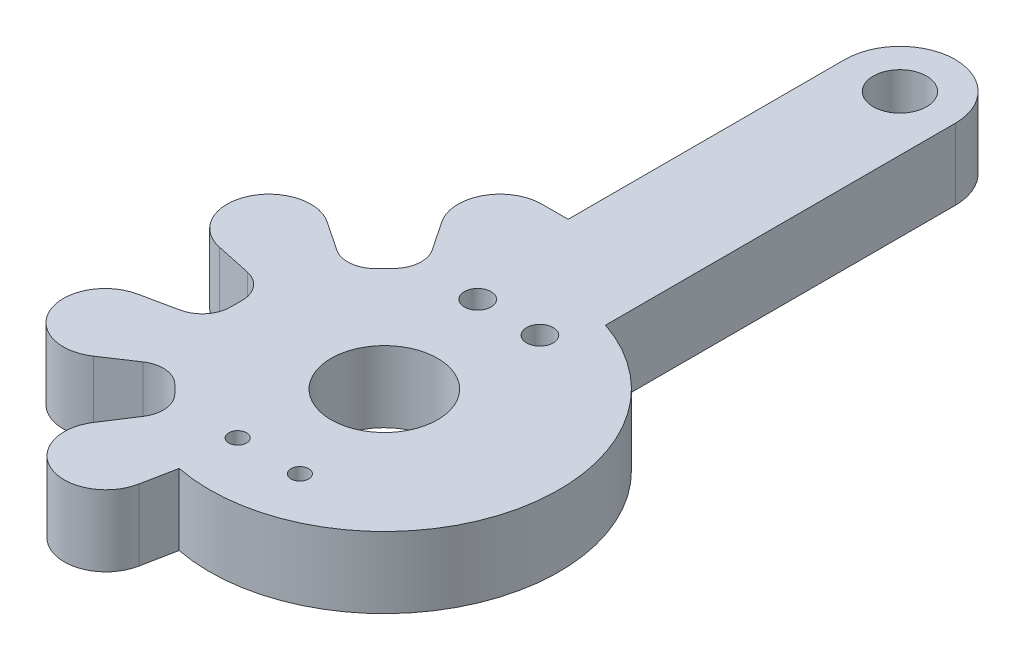
ISO-10303-21;
HEADER;
FILE_DESCRIPTION(('STEP AP214'),'2;1');
FILE_NAME('part.step','',(''),(''),'','','');
FILE_SCHEMA(('AUTOMOTIVE_DESIGN { 1 0 10303 214 1 1 1 1 }'));
ENDSEC;
DATA;
#1=APPLICATION_CONTEXT('core data for automotive mechanical design processes');
#2=APPLICATION_PROTOCOL_DEFINITION('international standard','automotive_design',2000,#1);
#3=PRODUCT_CONTEXT('',#1,'mechanical');
#4=PRODUCT('Part','Part','',(#3));
#5=PRODUCT_RELATED_PRODUCT_CATEGORY('part','',(#4));
#6=PRODUCT_DEFINITION_FORMATION('','',#4);
#7=PRODUCT_DEFINITION_CONTEXT('part definition',#1,'design');
#8=PRODUCT_DEFINITION('design','',#6,#7);
#9=PRODUCT_DEFINITION_SHAPE('','',#8);
#10=(LENGTH_UNIT() NAMED_UNIT(*) SI_UNIT(.MILLI.,.METRE.));
#11=(NAMED_UNIT(*) PLANE_ANGLE_UNIT() SI_UNIT($,.RADIAN.));
#12=(NAMED_UNIT(*) SI_UNIT($,.STERADIAN.) SOLID_ANGLE_UNIT());
#13=UNCERTAINTY_MEASURE_WITH_UNIT(LENGTH_MEASURE(1.E-05),#10,'distance_accuracy_value','');
#14=(GEOMETRIC_REPRESENTATION_CONTEXT(3) GLOBAL_UNCERTAINTY_ASSIGNED_CONTEXT((#13)) GLOBAL_UNIT_ASSIGNED_CONTEXT((#10,
#11,#12)) REPRESENTATION_CONTEXT('',''));
#15=CARTESIAN_POINT('',(0.,0.,0.));
#16=DIRECTION('',(0.,0.,1.));
#17=DIRECTION('',(1.,0.,0.));
#18=AXIS2_PLACEMENT_3D('',#15,#16,#17);
#19=CARTESIAN_POINT('',(-2.77114568886049,4.,-1.37659901968838));
#20=DIRECTION('',(0.,1.,0.));
#21=DIRECTION('',(0.,0.,1.));
#22=AXIS2_PLACEMENT_3D('',#19,#20,#21);
#23=PLANE('',#22);
#24=CARTESIAN_POINT('',(0.0592699758120881,4.,16.2086677180102));
#25=DIRECTION('',(0.,1.,0.));
#26=DIRECTION('',(0.,0.,1.));
#27=AXIS2_PLACEMENT_3D('',#24,#25,#26);
#28=CIRCLE('',#27,0.500000134967007);
#29=CARTESIAN_POINT('',(0.0592699758120881,4.,16.7086678529772));
#30=VERTEX_POINT('',#29);
#31=EDGE_CURVE('E548',#30,#30,#28,.T.);
#32=ORIENTED_EDGE('',*,*,#31,.F.);
#33=EDGE_LOOP('',(#32));
#34=FACE_BOUND('',#33,.T.);
#35=CARTESIAN_POINT('',(0.0592701716996304,4.,2.70866834817197));
#36=DIRECTION('',(0.,1.,0.));
#37=DIRECTION('',(0.,0.,1.));
#38=AXIS2_PLACEMENT_3D('',#35,#36,#37);
#39=CIRCLE('',#38,0.749999537832551);
#40=CARTESIAN_POINT('',(0.0592701716996304,4.,3.45866788600453));
#41=VERTEX_POINT('',#40);
#42=EDGE_CURVE('E564',#41,#41,#39,.T.);
#43=ORIENTED_EDGE('',*,*,#42,.F.);
#44=EDGE_LOOP('',(#43));
#45=FACE_BOUND('',#44,.T.);
#46=CARTESIAN_POINT('',(1.8065423913813,4.,-19.2908652195147));
#47=DIRECTION('',(0.,1.,0.));
#48=DIRECTION('',(0.,0.,1.));
#49=AXIS2_PLACEMENT_3D('',#46,#47,#48);
#50=CIRCLE('',#49,1.49817268986952);
#51=CARTESIAN_POINT('',(1.8065423913813,4.,-17.7926925296451));
#52=VERTEX_POINT('',#51);
#53=EDGE_CURVE('E248',#52,#52,#50,.T.);
#54=ORIENTED_EDGE('',*,*,#53,.F.);
#55=EDGE_LOOP('',(#54));
#56=FACE_BOUND('',#55,.T.);
#57=CARTESIAN_POINT('',(-2.77114568886049,4.,-1.37659901968838));
#58=DIRECTION('',(0.,1.,0.));
#59=DIRECTION('',(0.,0.,1.));
#60=AXIS2_PLACEMENT_3D('',#57,#58,#59);
#61=CIRCLE('',#60,2.35575318796541);
#62=CARTESIAN_POINT('',(-2.77114568886049,4.,-3.73235220765378));
#63=VERTEX_POINT('',#62);
#64=CARTESIAN_POINT('',(-4.72820100377529,4.,-0.0652990627857213));
#65=VERTEX_POINT('',#64);
#66=EDGE_CURVE('E317',#63,#65,#61,.T.);
#67=ORIENTED_EDGE('',*,*,#66,.T.);
#68=DIRECTION('',(0.556637241796619,0.,0.830755668680661));
#69=VECTOR('',#68,1.);
#70=CARTESIAN_POINT('',(-3.61887601999075,4.,1.59031782643565));
#71=LINE('',#70,#69);
#72=CARTESIAN_POINT('',(-3.61887601999075,4.,1.59031782643565));
#73=VERTEX_POINT('',#72);
#74=EDGE_CURVE('E151',#65,#73,#71,.T.);
#75=ORIENTED_EDGE('',*,*,#74,.T.);
#76=CARTESIAN_POINT('',(-4.92258097518152,4.,2.46384870649147));
#77=DIRECTION('',(0.,-1.,0.));
#78=DIRECTION('',(0.,0.,1.));
#79=AXIS2_PLACEMENT_3D('',#76,#77,#78);
#80=CIRCLE('',#79,1.56930010151024);
#81=CARTESIAN_POINT('',(-3.79736755831138,4.,3.55773973172912));
#82=VERTEX_POINT('',#81);
#83=EDGE_CURVE('E406',#73,#82,#80,.T.);
#84=ORIENTED_EDGE('',*,*,#83,.T.);
#85=DIRECTION('',(-0.69705662045451,0.,0.717016086207651));
#86=VECTOR('',#85,1.);
#87=CARTESIAN_POINT('',(-3.79736755831138,4.,3.55773973172912));
#88=LINE('',#87,#86);
#89=CARTESIAN_POINT('',(-4.29339014068072,4.,4.06796538663959));
#90=VERTEX_POINT('',#89);
#91=EDGE_CURVE('E426',#82,#90,#88,.T.);
#92=ORIENTED_EDGE('',*,*,#91,.T.);
#93=CARTESIAN_POINT('',(-5.4185998697706,4.,2.97407794652603));
#94=DIRECTION('',(0.,-1.,0.));
#95=DIRECTION('',(0.,0.,1.));
#96=AXIS2_PLACEMENT_3D('',#93,#94,#95);
#97=CIRCLE('',#96,1.56929495827799);
#98=CARTESIAN_POINT('',(-6.29210236905461,4.,4.2777957265004));
#99=VERTEX_POINT('',#98);
#100=EDGE_CURVE('E422',#90,#99,#97,.T.);
#101=ORIENTED_EDGE('',*,*,#100,.T.);
#102=DIRECTION('',(-0.83076656373443,0.,-0.556620981082178));
#103=VECTOR('',#102,1.);
#104=CARTESIAN_POINT('',(-7.95550620645628,4.,3.16330037205526));
#105=LINE('',#104,#103);
#106=CARTESIAN_POINT('',(-7.95550620645628,4.,3.16330037205526));
#107=VERTEX_POINT('',#106);
#108=EDGE_CURVE('E425',#99,#107,#105,.T.);
#109=ORIENTED_EDGE('',*,*,#108,.T.);
#110=CARTESIAN_POINT('',(-9.26716129206316,4.,5.12096856155806));
#111=DIRECTION('',(0.,1.,0.));
#112=DIRECTION('',(0.,0.,1.));
#113=AXIS2_PLACEMENT_3D('',#110,#111,#112);
#114=CIRCLE('',#113,2.35646001531738);
#115=CARTESIAN_POINT('',(-9.75601329683547,4.,7.42616432791277));
#116=VERTEX_POINT('',#115);
#117=EDGE_CURVE('E430',#107,#116,#114,.T.);
#118=ORIENTED_EDGE('',*,*,#117,.T.);
#119=DIRECTION('',(0.978245228593126,0.,0.207451856426458));
#120=VECTOR('',#119,1.);
#121=CARTESIAN_POINT('',(-9.75601329683547,4.,7.42616432791277));
#122=LINE('',#121,#120);
#123=CARTESIAN_POINT('',(-7.75613744660444,4.,7.85026857664959));
#124=VERTEX_POINT('',#123);
#125=EDGE_CURVE('E437',#116,#124,#122,.T.);
#126=ORIENTED_EDGE('',*,*,#125,.T.);
#127=CARTESIAN_POINT('',(-8.08169342099708,4.,9.38543718914396));
#128=DIRECTION('',(0.,-1.,0.));
#129=DIRECTION('',(0.,0.,1.));
#130=AXIS2_PLACEMENT_3D('',#127,#128,#129);
#131=CIRCLE('',#130,1.56930856151702);
#132=CARTESIAN_POINT('',(-6.51238485948006,4.,9.38543718914396));
#133=VERTEX_POINT('',#132);
#134=EDGE_CURVE('E440',#124,#133,#131,.T.);
#135=ORIENTED_EDGE('',*,*,#134,.T.);
#136=DIRECTION('',(0.,0.,1.));
#137=VECTOR('',#136,1.);
#138=CARTESIAN_POINT('',(-6.51238485948006,4.,9.38543718914396));
#139=LINE('',#138,#137);
#140=CARTESIAN_POINT('',(-6.51238485948006,4.,10.0334759794146));
#141=VERTEX_POINT('',#140);
#142=EDGE_CURVE('E443',#133,#141,#139,.T.);
#143=ORIENTED_EDGE('',*,*,#142,.T.);
#144=CARTESIAN_POINT('',(-8.11034225946571,4.,10.0334759794146));
#145=DIRECTION('',(0.,-1.,0.));
#146=DIRECTION('',(0.,0.,1.));
#147=AXIS2_PLACEMENT_3D('',#144,#145,#146);
#148=CIRCLE('',#147,1.59795739998566);
#149=CARTESIAN_POINT('',(-7.77884303034829,4.,11.5966701814457));
#150=VERTEX_POINT('',#149);
#151=EDGE_CURVE('E446',#141,#150,#148,.T.);
#152=ORIENTED_EDGE('',*,*,#151,.T.);
#153=DIRECTION('',(-0.978245228593126,0.,0.207451856426455));
#154=VECTOR('',#153,1.);
#155=CARTESIAN_POINT('',(-9.76840972187223,4.,12.0185882154692));
#156=LINE('',#155,#154);
#157=CARTESIAN_POINT('',(-9.76840972187223,4.,12.0185882154692));
#158=VERTEX_POINT('',#157);
#159=EDGE_CURVE('E449',#150,#158,#156,.T.);
#160=ORIENTED_EDGE('',*,*,#159,.T.);
#161=CARTESIAN_POINT('',(-9.28007806373352,4.,14.3213302722244));
#162=DIRECTION('',(0.,1.,0.));
#163=DIRECTION('',(0.,0.,1.));
#164=AXIS2_PLACEMENT_3D('',#161,#162,#163);
#165=CIRCLE('',#164,2.35395173873425);
#166=CARTESIAN_POINT('',(-7.97608815682557,4.,16.2811004401197));
#167=VERTEX_POINT('',#166);
#168=EDGE_CURVE('E452',#158,#167,#165,.T.);
#169=ORIENTED_EDGE('',*,*,#168,.T.);
#170=DIRECTION('',(0.832544752573836,0.,-0.553957791678907));
#171=VECTOR('',#170,1.);
#172=CARTESIAN_POINT('',(-7.97608815682557,4.,16.2811004401197));
#173=LINE('',#172,#171);
#174=CARTESIAN_POINT('',(-6.29980678761656,4.,15.1657380254882));
#175=VERTEX_POINT('',#174);
#176=EDGE_CURVE('E455',#167,#175,#173,.T.);
#177=ORIENTED_EDGE('',*,*,#176,.T.);
#178=CARTESIAN_POINT('',(-5.4304866029597,4.,16.4722418221928));
#179=DIRECTION('',(0.,-1.,0.));
#180=DIRECTION('',(0.,0.,1.));
#181=AXIS2_PLACEMENT_3D('',#178,#179,#180);
#182=CIRCLE('',#181,1.56928956991863);
#183=CARTESIAN_POINT('',(-4.32083130642491,4.,15.362586525658));
#184=VERTEX_POINT('',#183);
#185=EDGE_CURVE('E458',#175,#184,#182,.T.);
#186=ORIENTED_EDGE('',*,*,#185,.T.);
#187=DIRECTION('',(0.707106781186542,0.,0.707106781186553));
#188=VECTOR('',#187,1.);
#189=CARTESIAN_POINT('',(-3.84467982563202,4.,15.8387380064509));
#190=LINE('',#189,#188);
#191=CARTESIAN_POINT('',(-3.84467982563202,4.,15.8387380064509));
#192=VERTEX_POINT('',#191);
#193=EDGE_CURVE('E461',#184,#192,#190,.T.);
#194=ORIENTED_EDGE('',*,*,#193,.T.);
#195=CARTESIAN_POINT('',(-4.95433926293453,4.,16.9483974437535));
#196=DIRECTION('',(0.,-1.,0.));
#197=DIRECTION('',(0.,0.,1.));
#198=AXIS2_PLACEMENT_3D('',#195,#196,#197);
#199=CIRCLE('',#198,1.56929542584851);
#200=CARTESIAN_POINT('',(-3.638068078464,4.,17.8028670467948));
#201=VERTEX_POINT('',#200);
#202=EDGE_CURVE('E464',#192,#201,#199,.T.);
#203=ORIENTED_EDGE('',*,*,#202,.T.);
#204=DIRECTION('',(-0.544492508527712,0.,0.83876570516277));
#205=VECTOR('',#204,1.);
#206=CARTESIAN_POINT('',(-4.74295143728202,4.,19.5048891225208));
#207=LINE('',#206,#205);
#208=CARTESIAN_POINT('',(-4.74295143728203,4.,19.5048891225208));
#209=VERTEX_POINT('',#208);
#210=EDGE_CURVE('E467',#201,#209,#207,.T.);
#211=ORIENTED_EDGE('',*,*,#210,.T.);
#212=CARTESIAN_POINT('',(-2.77533245162566,4.,20.7821871697972));
#213=DIRECTION('',(0.,1.,0.));
#214=DIRECTION('',(0.,0.,1.));
#215=AXIS2_PLACEMENT_3D('',#212,#213,#214);
#216=CIRCLE('',#215,2.34585054389476);
#217=CARTESIAN_POINT('',(-0.473678479154287,4.,21.2354020915485));
#218=VERTEX_POINT('',#217);
#219=EDGE_CURVE('E470',#209,#218,#216,.T.);
#220=ORIENTED_EDGE('',*,*,#219,.T.);
#221=DIRECTION('',(0.193198549213155,0.,-0.981159681490191));
#222=VECTOR('',#221,1.);
#223=CARTESIAN_POINT('',(-0.473678479154287,4.,21.2354020915485));
#224=LINE('',#223,#222);
#225=CARTESIAN_POINT('',(-0.100533102020019,4.,19.3403816534051));
#226=VERTEX_POINT('',#225);
#227=EDGE_CURVE('E473',#218,#226,#224,.T.);
#228=ORIENTED_EDGE('',*,*,#227,.T.);
#229=CARTESIAN_POINT('',(1.79337725246014,4.,9.69513893205359));
#230=DIRECTION('',(0.,1.,0.));
#231=DIRECTION('',(0.,0.,1.));
#232=AXIS2_PLACEMENT_3D('',#229,#230,#231);
#233=CIRCLE('',#232,9.82942539442619);
#234=CARTESIAN_POINT('',(4.91427486245262,4.,0.374323426287286));
#235=VERTEX_POINT('',#234);
#236=EDGE_CURVE('E476',#226,#235,#233,.T.);
#237=ORIENTED_EDGE('',*,*,#236,.T.);
#238=DIRECTION('',(0.,0.,-1.));
#239=VECTOR('',#238,1.);
#240=CARTESIAN_POINT('',(4.91427486245262,4.,-19.296313943908));
#241=LINE('',#240,#239);
#242=CARTESIAN_POINT('',(4.91427486245262,4.,-19.296313943908));
#243=VERTEX_POINT('',#242);
#244=EDGE_CURVE('E221',#235,#243,#241,.T.);
#245=ORIENTED_EDGE('',*,*,#244,.T.);
#246=CARTESIAN_POINT('',(1.80927338060024,4.,-19.296313943908));
#247=DIRECTION('',(0.,1.,0.));
#248=DIRECTION('',(0.,0.,1.));
#249=AXIS2_PLACEMENT_3D('',#246,#247,#248);
#250=CIRCLE('',#249,3.10500148185238);
#251=CARTESIAN_POINT('',(-1.29572810125214,4.,-19.296313943908));
#252=VERTEX_POINT('',#251);
#253=EDGE_CURVE('E215',#243,#252,#250,.T.);
#254=ORIENTED_EDGE('',*,*,#253,.T.);
#255=DIRECTION('',(0.,0.,1.));
#256=VECTOR('',#255,1.);
#257=CARTESIAN_POINT('',(-1.29572810125211,4.,-3.73235220765378));
#258=LINE('',#257,#256);
#259=CARTESIAN_POINT('',(-1.29572810125211,4.,-3.73235220765378));
#260=VERTEX_POINT('',#259);
#261=EDGE_CURVE('E219',#252,#260,#258,.T.);
#262=ORIENTED_EDGE('',*,*,#261,.T.);
#263=DIRECTION('',(-1.,0.,0.));
#264=VECTOR('',#263,1.);
#265=CARTESIAN_POINT('',(-2.77114568886049,4.,-3.73235220765378));
#266=LINE('',#265,#264);
#267=EDGE_CURVE('E57',#260,#63,#266,.T.);
#268=ORIENTED_EDGE('',*,*,#267,.T.);
#269=EDGE_LOOP('',(#67,#75,#84,#92,#101,#109,#118,#126,#135,#143,#152,#160,#169,#177,#186,#194,
#203,#211,#220,#228,#237,#245,#254,#262,#268));
#270=FACE_BOUND('',#269,.T.);
#271=CARTESIAN_POINT('',(1.80610830984691,4.,9.70439482747588));
#272=DIRECTION('',(0.,1.,0.));
#273=DIRECTION('',(0.,0.,1.));
#274=AXIS2_PLACEMENT_3D('',#271,#272,#273);
#275=CIRCLE('',#274,2.99616408819573);
#276=CARTESIAN_POINT('',(1.80610830984691,4.,12.7005589156716));
#277=VERTEX_POINT('',#276);
#278=EDGE_CURVE('E572',#277,#277,#275,.T.);
#279=ORIENTED_EDGE('',*,*,#278,.F.);
#280=EDGE_LOOP('',(#279));
#281=FACE_BOUND('',#280,.T.);
#282=CARTESIAN_POINT('',(3.55927013748219,4.,2.70866920099618));
#283=DIRECTION('',(0.,1.,0.));
#284=DIRECTION('',(0.,0.,1.));
#285=AXIS2_PLACEMENT_3D('',#282,#283,#284);
#286=CIRCLE('',#285,0.749999676760298);
#287=CARTESIAN_POINT('',(3.55927013748219,4.,3.45866887775648));
#288=VERTEX_POINT('',#287);
#289=EDGE_CURVE('E556',#288,#288,#286,.T.);
#290=ORIENTED_EDGE('',*,*,#289,.F.);
#291=EDGE_LOOP('',(#290));
#292=FACE_BOUND('',#291,.T.);
#293=CARTESIAN_POINT('',(3.55927048546657,4.,16.2086678507145));
#294=DIRECTION('',(0.,1.,0.));
#295=DIRECTION('',(0.,0.,1.));
#296=AXIS2_PLACEMENT_3D('',#293,#294,#295);
#297=CIRCLE('',#296,0.499999787023919);
#298=CARTESIAN_POINT('',(3.55927048546657,4.,16.7086676377384));
#299=VERTEX_POINT('',#298);
#300=EDGE_CURVE('E537',#299,#299,#297,.T.);
#301=ORIENTED_EDGE('',*,*,#300,.F.);
#302=EDGE_LOOP('',(#301));
#303=FACE_BOUND('',#302,.T.);
#304=ADVANCED_FACE('F39',(#34,#45,#56,#270,#281,#292,#303),#23,.T.);
#305=CARTESIAN_POINT('',(-2.77114568886049,0.,-1.37659901968838));
#306=DIRECTION('',(0.,1.,0.));
#307=DIRECTION('',(0.,0.,1.));
#308=AXIS2_PLACEMENT_3D('',#305,#306,#307);
#309=PLANE('',#308);
#310=CARTESIAN_POINT('',(-2.77114568886049,0.,-1.37659901968838));
#311=DIRECTION('',(0.,1.,0.));
#312=DIRECTION('',(0.,0.,1.));
#313=AXIS2_PLACEMENT_3D('',#310,#311,#312);
#314=CIRCLE('',#313,2.35575318796541);
#315=CARTESIAN_POINT('',(-2.77114568886049,0.,-3.73235220765378));
#316=VERTEX_POINT('',#315);
#317=CARTESIAN_POINT('',(-4.72820100377529,0.,-0.0652990627857213));
#318=VERTEX_POINT('',#317);
#319=EDGE_CURVE('E243',#316,#318,#314,.T.);
#320=ORIENTED_EDGE('',*,*,#319,.F.);
#321=DIRECTION('',(-1.,0.,0.));
#322=VECTOR('',#321,1.);
#323=CARTESIAN_POINT('',(-2.77114568886049,0.,-3.73235220765378));
#324=LINE('',#323,#322);
#325=CARTESIAN_POINT('',(-1.29572810125211,0.,-3.73235220765378));
#326=VERTEX_POINT('',#325);
#327=EDGE_CURVE('E143',#326,#316,#324,.T.);
#328=ORIENTED_EDGE('',*,*,#327,.F.);
#329=DIRECTION('',(0.,0.,1.));
#330=VECTOR('',#329,1.);
#331=CARTESIAN_POINT('',(-1.29572810125211,0.,-3.73235220765378));
#332=LINE('',#331,#330);
#333=CARTESIAN_POINT('',(-1.29572810125214,0.,-19.296313943908));
#334=VERTEX_POINT('',#333);
#335=EDGE_CURVE('E137',#334,#326,#332,.T.);
#336=ORIENTED_EDGE('',*,*,#335,.F.);
#337=CARTESIAN_POINT('',(1.80927338060024,0.,-19.296313943908));
#338=DIRECTION('',(0.,1.,0.));
#339=DIRECTION('',(0.,0.,1.));
#340=AXIS2_PLACEMENT_3D('',#337,#338,#339);
#341=CIRCLE('',#340,3.10500148185238);
#342=CARTESIAN_POINT('',(4.91427486245262,0.,-19.296313943908));
#343=VERTEX_POINT('',#342);
#344=EDGE_CURVE('E230',#343,#334,#341,.T.);
#345=ORIENTED_EDGE('',*,*,#344,.F.);
#346=DIRECTION('',(0.,0.,-1.));
#347=VECTOR('',#346,1.);
#348=CARTESIAN_POINT('',(4.91427486245262,0.,-19.296313943908));
#349=LINE('',#348,#347);
#350=CARTESIAN_POINT('',(4.91427486245262,0.,0.374323426287286));
#351=VERTEX_POINT('',#350);
#352=EDGE_CURVE('E308',#351,#343,#349,.T.);
#353=ORIENTED_EDGE('',*,*,#352,.F.);
#354=CARTESIAN_POINT('',(1.79337725246014,0.,9.69513893205359));
#355=DIRECTION('',(0.,1.,0.));
#356=DIRECTION('',(0.,0.,1.));
#357=AXIS2_PLACEMENT_3D('',#354,#355,#356);
#358=CIRCLE('',#357,9.82942539442619);
#359=CARTESIAN_POINT('',(-0.100533102020019,0.,19.3403816534051));
#360=VERTEX_POINT('',#359);
#361=EDGE_CURVE('E305',#360,#351,#358,.T.);
#362=ORIENTED_EDGE('',*,*,#361,.F.);
#363=DIRECTION('',(0.193198549213155,0.,-0.981159681490191));
#364=VECTOR('',#363,1.);
#365=CARTESIAN_POINT('',(-0.473678479154287,0.,21.2354020915485));
#366=LINE('',#365,#364);
#367=CARTESIAN_POINT('',(-0.473678479154287,0.,21.2354020915485));
#368=VERTEX_POINT('',#367);
#369=EDGE_CURVE('E302',#368,#360,#366,.T.);
#370=ORIENTED_EDGE('',*,*,#369,.F.);
#371=CARTESIAN_POINT('',(-2.77533245162566,0.,20.7821871697972));
#372=DIRECTION('',(0.,1.,0.));
#373=DIRECTION('',(0.,0.,1.));
#374=AXIS2_PLACEMENT_3D('',#371,#372,#373);
#375=CIRCLE('',#374,2.34585054389476);
#376=CARTESIAN_POINT('',(-4.74295143728203,0.,19.5048891225208));
#377=VERTEX_POINT('',#376);
#378=EDGE_CURVE('E299',#377,#368,#375,.T.);
#379=ORIENTED_EDGE('',*,*,#378,.F.);
#380=DIRECTION('',(-0.544492508527712,0.,0.83876570516277));
#381=VECTOR('',#380,1.);
#382=CARTESIAN_POINT('',(-4.74295143728202,0.,19.5048891225208));
#383=LINE('',#382,#381);
#384=CARTESIAN_POINT('',(-3.638068078464,0.,17.8028670467948));
#385=VERTEX_POINT('',#384);
#386=EDGE_CURVE('E296',#385,#377,#383,.T.);
#387=ORIENTED_EDGE('',*,*,#386,.F.);
#388=CARTESIAN_POINT('',(-4.95433926293453,0.,16.9483974437535));
#389=DIRECTION('',(0.,-1.,0.));
#390=DIRECTION('',(0.,0.,1.));
#391=AXIS2_PLACEMENT_3D('',#388,#389,#390);
#392=CIRCLE('',#391,1.56929542584851);
#393=CARTESIAN_POINT('',(-3.84467982563202,0.,15.8387380064509));
#394=VERTEX_POINT('',#393);
#395=EDGE_CURVE('E293',#394,#385,#392,.T.);
#396=ORIENTED_EDGE('',*,*,#395,.F.);
#397=DIRECTION('',(0.707106781186542,0.,0.707106781186553));
#398=VECTOR('',#397,1.);
#399=CARTESIAN_POINT('',(-3.84467982563202,0.,15.8387380064509));
#400=LINE('',#399,#398);
#401=CARTESIAN_POINT('',(-4.32083130642491,0.,15.362586525658));
#402=VERTEX_POINT('',#401);
#403=EDGE_CURVE('E290',#402,#394,#400,.T.);
#404=ORIENTED_EDGE('',*,*,#403,.F.);
#405=CARTESIAN_POINT('',(-5.4304866029597,0.,16.4722418221928));
#406=DIRECTION('',(0.,-1.,0.));
#407=DIRECTION('',(0.,0.,1.));
#408=AXIS2_PLACEMENT_3D('',#405,#406,#407);
#409=CIRCLE('',#408,1.56928956991863);
#410=CARTESIAN_POINT('',(-6.29980678761656,0.,15.1657380254882));
#411=VERTEX_POINT('',#410);
#412=EDGE_CURVE('E287',#411,#402,#409,.T.);
#413=ORIENTED_EDGE('',*,*,#412,.F.);
#414=DIRECTION('',(0.832544752573836,0.,-0.553957791678907));
#415=VECTOR('',#414,1.);
#416=CARTESIAN_POINT('',(-7.97608815682557,0.,16.2811004401197));
#417=LINE('',#416,#415);
#418=CARTESIAN_POINT('',(-7.97608815682557,0.,16.2811004401197));
#419=VERTEX_POINT('',#418);
#420=EDGE_CURVE('E284',#419,#411,#417,.T.);
#421=ORIENTED_EDGE('',*,*,#420,.F.);
#422=CARTESIAN_POINT('',(-9.28007806373352,0.,14.3213302722244));
#423=DIRECTION('',(0.,1.,0.));
#424=DIRECTION('',(0.,0.,1.));
#425=AXIS2_PLACEMENT_3D('',#422,#423,#424);
#426=CIRCLE('',#425,2.35395173873425);
#427=CARTESIAN_POINT('',(-9.76840972187223,0.,12.0185882154692));
#428=VERTEX_POINT('',#427);
#429=EDGE_CURVE('E281',#428,#419,#426,.T.);
#430=ORIENTED_EDGE('',*,*,#429,.F.);
#431=DIRECTION('',(-0.978245228593126,0.,0.207451856426455));
#432=VECTOR('',#431,1.);
#433=CARTESIAN_POINT('',(-9.76840972187223,0.,12.0185882154692));
#434=LINE('',#433,#432);
#435=CARTESIAN_POINT('',(-7.77884303034829,0.,11.5966701814457));
#436=VERTEX_POINT('',#435);
#437=EDGE_CURVE('E278',#436,#428,#434,.T.);
#438=ORIENTED_EDGE('',*,*,#437,.F.);
#439=CARTESIAN_POINT('',(-8.11034225946571,0.,10.0334759794146));
#440=DIRECTION('',(0.,-1.,0.));
#441=DIRECTION('',(0.,0.,1.));
#442=AXIS2_PLACEMENT_3D('',#439,#440,#441);
#443=CIRCLE('',#442,1.59795739998566);
#444=CARTESIAN_POINT('',(-6.51238485948006,0.,10.0334759794146));
#445=VERTEX_POINT('',#444);
#446=EDGE_CURVE('E275',#445,#436,#443,.T.);
#447=ORIENTED_EDGE('',*,*,#446,.F.);
#448=DIRECTION('',(0.,0.,1.));
#449=VECTOR('',#448,1.);
#450=CARTESIAN_POINT('',(-6.51238485948006,0.,9.38543718914396));
#451=LINE('',#450,#449);
#452=CARTESIAN_POINT('',(-6.51238485948006,0.,9.38543718914396));
#453=VERTEX_POINT('',#452);
#454=EDGE_CURVE('E272',#453,#445,#451,.T.);
#455=ORIENTED_EDGE('',*,*,#454,.F.);
#456=CARTESIAN_POINT('',(-8.08169342099708,0.,9.38543718914396));
#457=DIRECTION('',(0.,-1.,0.));
#458=DIRECTION('',(0.,0.,1.));
#459=AXIS2_PLACEMENT_3D('',#456,#457,#458);
#460=CIRCLE('',#459,1.56930856151702);
#461=CARTESIAN_POINT('',(-7.75613744660444,0.,7.85026857664959));
#462=VERTEX_POINT('',#461);
#463=EDGE_CURVE('E269',#462,#453,#460,.T.);
#464=ORIENTED_EDGE('',*,*,#463,.F.);
#465=DIRECTION('',(0.978245228593126,0.,0.207451856426458));
#466=VECTOR('',#465,1.);
#467=CARTESIAN_POINT('',(-9.75601329683547,0.,7.42616432791277));
#468=LINE('',#467,#466);
#469=CARTESIAN_POINT('',(-9.75601329683547,0.,7.42616432791277));
#470=VERTEX_POINT('',#469);
#471=EDGE_CURVE('E266',#470,#462,#468,.T.);
#472=ORIENTED_EDGE('',*,*,#471,.F.);
#473=CARTESIAN_POINT('',(-9.26716129206316,0.,5.12096856155806));
#474=DIRECTION('',(0.,1.,0.));
#475=DIRECTION('',(0.,0.,1.));
#476=AXIS2_PLACEMENT_3D('',#473,#474,#475);
#477=CIRCLE('',#476,2.35646001531738);
#478=CARTESIAN_POINT('',(-7.95550620645628,0.,3.16330037205526));
#479=VERTEX_POINT('',#478);
#480=EDGE_CURVE('E263',#479,#470,#477,.T.);
#481=ORIENTED_EDGE('',*,*,#480,.F.);
#482=DIRECTION('',(-0.83076656373443,0.,-0.556620981082178));
#483=VECTOR('',#482,1.);
#484=CARTESIAN_POINT('',(-7.95550620645628,0.,3.16330037205526));
#485=LINE('',#484,#483);
#486=CARTESIAN_POINT('',(-6.29210236905461,0.,4.2777957265004));
#487=VERTEX_POINT('',#486);
#488=EDGE_CURVE('E260',#487,#479,#485,.T.);
#489=ORIENTED_EDGE('',*,*,#488,.F.);
#490=CARTESIAN_POINT('',(-5.4185998697706,0.,2.97407794652603));
#491=DIRECTION('',(0.,-1.,0.));
#492=DIRECTION('',(0.,0.,1.));
#493=AXIS2_PLACEMENT_3D('',#490,#491,#492);
#494=CIRCLE('',#493,1.56929495827799);
#495=CARTESIAN_POINT('',(-4.29339014068072,0.,4.06796538663959));
#496=VERTEX_POINT('',#495);
#497=EDGE_CURVE('E257',#496,#487,#494,.T.);
#498=ORIENTED_EDGE('',*,*,#497,.F.);
#499=DIRECTION('',(-0.69705662045451,0.,0.717016086207651));
#500=VECTOR('',#499,1.);
#501=CARTESIAN_POINT('',(-3.79736755831138,0.,3.55773973172912));
#502=LINE('',#501,#500);
#503=CARTESIAN_POINT('',(-3.79736755831138,0.,3.55773973172912));
#504=VERTEX_POINT('',#503);
#505=EDGE_CURVE('E254',#504,#496,#502,.T.);
#506=ORIENTED_EDGE('',*,*,#505,.F.);
#507=CARTESIAN_POINT('',(-4.92258097518152,0.,2.46384870649147));
#508=DIRECTION('',(0.,-1.,0.));
#509=DIRECTION('',(0.,0.,1.));
#510=AXIS2_PLACEMENT_3D('',#507,#508,#509);
#511=CIRCLE('',#510,1.56930010151024);
#512=CARTESIAN_POINT('',(-3.61887601999075,0.,1.59031782643565));
#513=VERTEX_POINT('',#512);
#514=EDGE_CURVE('E251',#513,#504,#511,.T.);
#515=ORIENTED_EDGE('',*,*,#514,.F.);
#516=DIRECTION('',(0.556637241796619,0.,0.830755668680661));
#517=VECTOR('',#516,1.);
#518=CARTESIAN_POINT('',(-3.61887601999075,0.,1.59031782643565));
#519=LINE('',#518,#517);
#520=EDGE_CURVE('E247',#318,#513,#519,.T.);
#521=ORIENTED_EDGE('',*,*,#520,.F.);
#522=EDGE_LOOP('',(#320,#328,#336,#345,#353,#362,#370,#379,#387,#396,#404,#413,#421,#430,#438,
#447,#455,#464,#472,#481,#489,#498,#506,#515,#521));
#523=FACE_BOUND('',#522,.T.);
#524=CARTESIAN_POINT('',(1.8065423913813,0.,-19.2908652195147));
#525=DIRECTION('',(0.,1.,0.));
#526=DIRECTION('',(0.,0.,1.));
#527=AXIS2_PLACEMENT_3D('',#524,#525,#526);
#528=CIRCLE('',#527,1.49817268986952);
#529=CARTESIAN_POINT('',(1.8065423913813,0.,-17.7926925296451));
#530=VERTEX_POINT('',#529);
#531=EDGE_CURVE('E576',#530,#530,#528,.T.);
#532=ORIENTED_EDGE('',*,*,#531,.T.);
#533=EDGE_LOOP('',(#532));
#534=FACE_BOUND('',#533,.T.);
#535=CARTESIAN_POINT('',(1.80610830984691,0.,9.70439482747588));
#536=DIRECTION('',(0.,1.,0.));
#537=DIRECTION('',(0.,0.,1.));
#538=AXIS2_PLACEMENT_3D('',#535,#536,#537);
#539=CIRCLE('',#538,2.99616408819573);
#540=CARTESIAN_POINT('',(1.80610830984691,0.,12.7005589156716));
#541=VERTEX_POINT('',#540);
#542=EDGE_CURVE('E568',#541,#541,#539,.T.);
#543=ORIENTED_EDGE('',*,*,#542,.T.);
#544=EDGE_LOOP('',(#543));
#545=FACE_BOUND('',#544,.T.);
#546=CARTESIAN_POINT('',(0.0592701716996304,0.,2.70866834817197));
#547=DIRECTION('',(0.,1.,0.));
#548=DIRECTION('',(0.,0.,1.));
#549=AXIS2_PLACEMENT_3D('',#546,#547,#548);
#550=CIRCLE('',#549,0.749999537832551);
#551=CARTESIAN_POINT('',(0.0592701716996304,0.,3.45866788600453));
#552=VERTEX_POINT('',#551);
#553=EDGE_CURVE('E560',#552,#552,#550,.T.);
#554=ORIENTED_EDGE('',*,*,#553,.T.);
#555=EDGE_LOOP('',(#554));
#556=FACE_BOUND('',#555,.T.);
#557=CARTESIAN_POINT('',(3.55927013748219,0.,2.70866920099618));
#558=DIRECTION('',(0.,1.,0.));
#559=DIRECTION('',(0.,0.,1.));
#560=AXIS2_PLACEMENT_3D('',#557,#558,#559);
#561=CIRCLE('',#560,0.749999676760298);
#562=CARTESIAN_POINT('',(3.55927013748219,0.,3.45866887775648));
#563=VERTEX_POINT('',#562);
#564=EDGE_CURVE('E552',#563,#563,#561,.T.);
#565=ORIENTED_EDGE('',*,*,#564,.T.);
#566=EDGE_LOOP('',(#565));
#567=FACE_BOUND('',#566,.T.);
#568=CARTESIAN_POINT('',(0.0592699758120881,0.,16.2086677180102));
#569=DIRECTION('',(0.,1.,0.));
#570=DIRECTION('',(0.,0.,1.));
#571=AXIS2_PLACEMENT_3D('',#568,#569,#570);
#572=CIRCLE('',#571,0.500000134967007);
#573=CARTESIAN_POINT('',(0.0592699758120881,0.,16.7086678529772));
#574=VERTEX_POINT('',#573);
#575=EDGE_CURVE('E545',#574,#574,#572,.T.);
#576=ORIENTED_EDGE('',*,*,#575,.T.);
#577=EDGE_LOOP('',(#576));
#578=FACE_BOUND('',#577,.T.);
#579=CARTESIAN_POINT('',(3.55927048546657,0.,16.2086678507145));
#580=DIRECTION('',(0.,1.,0.));
#581=DIRECTION('',(0.,0.,1.));
#582=AXIS2_PLACEMENT_3D('',#579,#580,#581);
#583=CIRCLE('',#582,0.499999787023919);
#584=CARTESIAN_POINT('',(3.55927048546657,0.,16.7086676377384));
#585=VERTEX_POINT('',#584);
#586=EDGE_CURVE('E540',#585,#585,#583,.T.);
#587=ORIENTED_EDGE('',*,*,#586,.T.);
#588=EDGE_LOOP('',(#587));
#589=FACE_BOUND('',#588,.T.);
#590=ADVANCED_FACE('F410',(#523,#534,#545,#556,#567,#578,#589),#309,.F.);
#591=CARTESIAN_POINT('',(-2.77114568886049,4.,-1.37659901968838));
#592=DIRECTION('',(0.,-1.,0.));
#593=DIRECTION('',(0.,0.,-1.));
#594=AXIS2_PLACEMENT_3D('',#591,#592,#593);
#595=CYLINDRICAL_SURFACE('',#594,2.35575318796541);
#596=ORIENTED_EDGE('',*,*,#319,.T.);
#597=DIRECTION('',(0.,-1.,0.));
#598=VECTOR('',#597,1.);
#599=CARTESIAN_POINT('',(-4.72820100377529,4.,-0.0652990627857213));
#600=LINE('',#599,#598);
#601=EDGE_CURVE('E11',#65,#318,#600,.T.);
#602=ORIENTED_EDGE('',*,*,#601,.F.);
#603=ORIENTED_EDGE('',*,*,#66,.F.);
#604=DIRECTION('',(0.,-1.,0.));
#605=VECTOR('',#604,1.);
#606=CARTESIAN_POINT('',(-2.77114568886049,4.,-3.73235220765378));
#607=LINE('',#606,#605);
#608=EDGE_CURVE('E239',#63,#316,#607,.T.);
#609=ORIENTED_EDGE('',*,*,#608,.T.);
#610=EDGE_LOOP('',(#596,#602,#603,#609));
#611=FACE_BOUND('',#610,.T.);
#612=ADVANCED_FACE('F41',(#611),#595,.T.);
#613=CARTESIAN_POINT('',(-3.61887601999075,4.,1.59031782643565));
#614=DIRECTION('',(0.830755668680661,0.,-0.55663724179662));
#615=DIRECTION('',(-0.556637241796619,0.,-0.830755668680661));
#616=AXIS2_PLACEMENT_3D('',#613,#614,#615);
#617=PLANE('',#616);
#618=ORIENTED_EDGE('',*,*,#520,.T.);
#619=DIRECTION('',(0.,-1.,0.));
#620=VECTOR('',#619,1.);
#621=CARTESIAN_POINT('',(-3.61887601999075,4.,1.59031782643565));
#622=LINE('',#621,#620);
#623=EDGE_CURVE('E49',#73,#513,#622,.T.);
#624=ORIENTED_EDGE('',*,*,#623,.F.);
#625=ORIENTED_EDGE('',*,*,#74,.F.);
#626=ORIENTED_EDGE('',*,*,#601,.T.);
#627=EDGE_LOOP('',(#618,#624,#625,#626));
#628=FACE_BOUND('',#627,.T.);
#629=ADVANCED_FACE('F840',(#628),#617,.F.);
#630=CARTESIAN_POINT('',(-4.92258097518152,4.,2.46384870649147));
#631=DIRECTION('',(0.,-1.,0.));
#632=DIRECTION('',(0.,0.,-1.));
#633=AXIS2_PLACEMENT_3D('',#630,#631,#632);
#634=CYLINDRICAL_SURFACE('',#633,1.56930010151024);
#635=ORIENTED_EDGE('',*,*,#514,.T.);
#636=DIRECTION('',(0.,-1.,0.));
#637=VECTOR('',#636,1.);
#638=CARTESIAN_POINT('',(-3.79736755831138,4.,3.55773973172912));
#639=LINE('',#638,#637);
#640=EDGE_CURVE('E396',#82,#504,#639,.T.);
#641=ORIENTED_EDGE('',*,*,#640,.F.);
#642=ORIENTED_EDGE('',*,*,#83,.F.);
#643=ORIENTED_EDGE('',*,*,#623,.T.);
#644=EDGE_LOOP('',(#635,#641,#642,#643));
#645=FACE_BOUND('',#644,.T.);
#646=ADVANCED_FACE('F404',(#645),#634,.F.);
#647=CARTESIAN_POINT('',(-3.79736755831138,4.,3.55773973172912));
#648=DIRECTION('',(0.717016086207651,0.,0.69705662045451));
#649=DIRECTION('',(0.69705662045451,0.,-0.717016086207651));
#650=AXIS2_PLACEMENT_3D('',#647,#648,#649);
#651=PLANE('',#650);
#652=ORIENTED_EDGE('',*,*,#505,.T.);
#653=DIRECTION('',(0.,-1.,0.));
#654=VECTOR('',#653,1.);
#655=CARTESIAN_POINT('',(-4.29339014068072,4.,4.06796538663959));
#656=LINE('',#655,#654);
#657=EDGE_CURVE('E392',#90,#496,#656,.T.);
#658=ORIENTED_EDGE('',*,*,#657,.F.);
#659=ORIENTED_EDGE('',*,*,#91,.F.);
#660=ORIENTED_EDGE('',*,*,#640,.T.);
#661=EDGE_LOOP('',(#652,#658,#659,#660));
#662=FACE_BOUND('',#661,.T.);
#663=ADVANCED_FACE('F416',(#662),#651,.F.);
#664=CARTESIAN_POINT('',(-5.4185998697706,4.,2.97407794652603));
#665=DIRECTION('',(0.,-1.,0.));
#666=DIRECTION('',(0.,0.,-1.));
#667=AXIS2_PLACEMENT_3D('',#664,#665,#666);
#668=CYLINDRICAL_SURFACE('',#667,1.56929495827799);
#669=ORIENTED_EDGE('',*,*,#497,.T.);
#670=DIRECTION('',(0.,-1.,0.));
#671=VECTOR('',#670,1.);
#672=CARTESIAN_POINT('',(-6.29210236905461,4.,4.2777957265004));
#673=LINE('',#672,#671);
#674=EDGE_CURVE('E388',#99,#487,#673,.T.);
#675=ORIENTED_EDGE('',*,*,#674,.F.);
#676=ORIENTED_EDGE('',*,*,#100,.F.);
#677=ORIENTED_EDGE('',*,*,#657,.T.);
#678=EDGE_LOOP('',(#669,#675,#676,#677));
#679=FACE_BOUND('',#678,.T.);
#680=ADVANCED_FACE('F420',(#679),#668,.F.);
#681=CARTESIAN_POINT('',(-7.95550620645628,4.,3.16330037205526));
#682=DIRECTION('',(-0.556620981082178,0.,0.830766563734431));
#683=DIRECTION('',(0.830766563734431,0.,0.556620981082178));
#684=AXIS2_PLACEMENT_3D('',#681,#682,#683);
#685=PLANE('',#684);
#686=ORIENTED_EDGE('',*,*,#488,.T.);
#687=DIRECTION('',(0.,-1.,0.));
#688=VECTOR('',#687,1.);
#689=CARTESIAN_POINT('',(-7.95550620645628,4.,3.16330037205526));
#690=LINE('',#689,#688);
#691=EDGE_CURVE('E384',#107,#479,#690,.T.);
#692=ORIENTED_EDGE('',*,*,#691,.F.);
#693=ORIENTED_EDGE('',*,*,#108,.F.);
#694=ORIENTED_EDGE('',*,*,#674,.T.);
#695=EDGE_LOOP('',(#686,#692,#693,#694));
#696=FACE_BOUND('',#695,.T.);
#697=ADVANCED_FACE('F805',(#696),#685,.F.);
#698=CARTESIAN_POINT('',(-9.26716129206316,4.,5.12096856155806));
#699=DIRECTION('',(0.,-1.,0.));
#700=DIRECTION('',(0.,0.,-1.));
#701=AXIS2_PLACEMENT_3D('',#698,#699,#700);
#702=CYLINDRICAL_SURFACE('',#701,2.35646001531738);
#703=ORIENTED_EDGE('',*,*,#480,.T.);
#704=DIRECTION('',(0.,-1.,0.));
#705=VECTOR('',#704,1.);
#706=CARTESIAN_POINT('',(-9.75601329683547,4.,7.42616432791277));
#707=LINE('',#706,#705);
#708=EDGE_CURVE('E380',#116,#470,#707,.T.);
#709=ORIENTED_EDGE('',*,*,#708,.F.);
#710=ORIENTED_EDGE('',*,*,#117,.F.);
#711=ORIENTED_EDGE('',*,*,#691,.T.);
#712=EDGE_LOOP('',(#703,#709,#710,#711));
#713=FACE_BOUND('',#712,.T.);
#714=ADVANCED_FACE('F795',(#713),#702,.T.);
#715=CARTESIAN_POINT('',(-9.75601329683547,4.,7.42616432791277));
#716=DIRECTION('',(0.207451856426458,0.,-0.978245228593126));
#717=DIRECTION('',(-0.978245228593126,0.,-0.207451856426458));
#718=AXIS2_PLACEMENT_3D('',#715,#716,#717);
#719=PLANE('',#718);
#720=ORIENTED_EDGE('',*,*,#471,.T.);
#721=DIRECTION('',(0.,-1.,0.));
#722=VECTOR('',#721,1.);
#723=CARTESIAN_POINT('',(-7.75613744660444,4.,7.85026857664959));
#724=LINE('',#723,#722);
#725=EDGE_CURVE('E376',#124,#462,#724,.T.);
#726=ORIENTED_EDGE('',*,*,#725,.F.);
#727=ORIENTED_EDGE('',*,*,#125,.F.);
#728=ORIENTED_EDGE('',*,*,#708,.T.);
#729=EDGE_LOOP('',(#720,#726,#727,#728));
#730=FACE_BOUND('',#729,.T.);
#731=ADVANCED_FACE('F785',(#730),#719,.F.);
#732=CARTESIAN_POINT('',(-8.08169342099708,4.,9.38543718914396));
#733=DIRECTION('',(0.,-1.,0.));
#734=DIRECTION('',(0.,0.,-1.));
#735=AXIS2_PLACEMENT_3D('',#732,#733,#734);
#736=CYLINDRICAL_SURFACE('',#735,1.56930856151702);
#737=ORIENTED_EDGE('',*,*,#463,.T.);
#738=DIRECTION('',(0.,-1.,0.));
#739=VECTOR('',#738,1.);
#740=CARTESIAN_POINT('',(-6.51238485948006,4.,9.38543718914396));
#741=LINE('',#740,#739);
#742=EDGE_CURVE('E372',#133,#453,#741,.T.);
#743=ORIENTED_EDGE('',*,*,#742,.F.);
#744=ORIENTED_EDGE('',*,*,#134,.F.);
#745=ORIENTED_EDGE('',*,*,#725,.T.);
#746=EDGE_LOOP('',(#737,#743,#744,#745));
#747=FACE_BOUND('',#746,.T.);
#748=ADVANCED_FACE('F775',(#747),#736,.F.);
#749=CARTESIAN_POINT('',(-6.51238485948006,4.,9.38543718914396));
#750=DIRECTION('',(1.,0.,0.));
#751=DIRECTION('',(0.,0.,-1.));
#752=AXIS2_PLACEMENT_3D('',#749,#750,#751);
#753=PLANE('',#752);
#754=ORIENTED_EDGE('',*,*,#454,.T.);
#755=DIRECTION('',(0.,-1.,0.));
#756=VECTOR('',#755,1.);
#757=CARTESIAN_POINT('',(-6.51238485948006,4.,10.0334759794146));
#758=LINE('',#757,#756);
#759=EDGE_CURVE('E368',#141,#445,#758,.T.);
#760=ORIENTED_EDGE('',*,*,#759,.F.);
#761=ORIENTED_EDGE('',*,*,#142,.F.);
#762=ORIENTED_EDGE('',*,*,#742,.T.);
#763=EDGE_LOOP('',(#754,#760,#761,#762));
#764=FACE_BOUND('',#763,.T.);
#765=ADVANCED_FACE('F765',(#764),#753,.F.);
#766=CARTESIAN_POINT('',(-8.11034225946571,4.,10.0334759794146));
#767=DIRECTION('',(0.,-1.,0.));
#768=DIRECTION('',(0.,0.,-1.));
#769=AXIS2_PLACEMENT_3D('',#766,#767,#768);
#770=CYLINDRICAL_SURFACE('',#769,1.59795739998566);
#771=ORIENTED_EDGE('',*,*,#446,.T.);
#772=DIRECTION('',(0.,-1.,0.));
#773=VECTOR('',#772,1.);
#774=CARTESIAN_POINT('',(-7.77884303034829,4.,11.5966701814457));
#775=LINE('',#774,#773);
#776=EDGE_CURVE('E364',#150,#436,#775,.T.);
#777=ORIENTED_EDGE('',*,*,#776,.F.);
#778=ORIENTED_EDGE('',*,*,#151,.F.);
#779=ORIENTED_EDGE('',*,*,#759,.T.);
#780=EDGE_LOOP('',(#771,#777,#778,#779));
#781=FACE_BOUND('',#780,.T.);
#782=ADVANCED_FACE('F755',(#781),#770,.F.);
#783=CARTESIAN_POINT('',(-9.76840972187223,4.,12.0185882154692));
#784=DIRECTION('',(0.207451856426455,0.,0.978245228593126));
#785=DIRECTION('',(0.978245228593126,0.,-0.207451856426455));
#786=AXIS2_PLACEMENT_3D('',#783,#784,#785);
#787=PLANE('',#786);
#788=ORIENTED_EDGE('',*,*,#437,.T.);
#789=DIRECTION('',(0.,-1.,0.));
#790=VECTOR('',#789,1.);
#791=CARTESIAN_POINT('',(-9.76840972187223,4.,12.0185882154692));
#792=LINE('',#791,#790);
#793=EDGE_CURVE('E360',#158,#428,#792,.T.);
#794=ORIENTED_EDGE('',*,*,#793,.F.);
#795=ORIENTED_EDGE('',*,*,#159,.F.);
#796=ORIENTED_EDGE('',*,*,#776,.T.);
#797=EDGE_LOOP('',(#788,#794,#795,#796));
#798=FACE_BOUND('',#797,.T.);
#799=ADVANCED_FACE('F745',(#798),#787,.F.);
#800=CARTESIAN_POINT('',(-9.28007806373352,4.,14.3213302722244));
#801=DIRECTION('',(0.,-1.,0.));
#802=DIRECTION('',(0.,0.,-1.));
#803=AXIS2_PLACEMENT_3D('',#800,#801,#802);
#804=CYLINDRICAL_SURFACE('',#803,2.35395173873425);
#805=ORIENTED_EDGE('',*,*,#429,.T.);
#806=DIRECTION('',(0.,-1.,0.));
#807=VECTOR('',#806,1.);
#808=CARTESIAN_POINT('',(-7.97608815682557,4.,16.2811004401197));
#809=LINE('',#808,#807);
#810=EDGE_CURVE('E356',#167,#419,#809,.T.);
#811=ORIENTED_EDGE('',*,*,#810,.F.);
#812=ORIENTED_EDGE('',*,*,#168,.F.);
#813=ORIENTED_EDGE('',*,*,#793,.T.);
#814=EDGE_LOOP('',(#805,#811,#812,#813));
#815=FACE_BOUND('',#814,.T.);
#816=ADVANCED_FACE('F735',(#815),#804,.T.);
#817=CARTESIAN_POINT('',(-7.97608815682557,4.,16.2811004401197));
#818=DIRECTION('',(-0.553957791678907,0.,-0.832544752573835));
#819=DIRECTION('',(-0.832544752573836,0.,0.553957791678907));
#820=AXIS2_PLACEMENT_3D('',#817,#818,#819);
#821=PLANE('',#820);
#822=ORIENTED_EDGE('',*,*,#420,.T.);
#823=DIRECTION('',(0.,-1.,0.));
#824=VECTOR('',#823,1.);
#825=CARTESIAN_POINT('',(-6.29980678761656,4.,15.1657380254882));
#826=LINE('',#825,#824);
#827=EDGE_CURVE('E352',#175,#411,#826,.T.);
#828=ORIENTED_EDGE('',*,*,#827,.F.);
#829=ORIENTED_EDGE('',*,*,#176,.F.);
#830=ORIENTED_EDGE('',*,*,#810,.T.);
#831=EDGE_LOOP('',(#822,#828,#829,#830));
#832=FACE_BOUND('',#831,.T.);
#833=ADVANCED_FACE('F725',(#832),#821,.F.);
#834=CARTESIAN_POINT('',(-5.4304866029597,4.,16.4722418221928));
#835=DIRECTION('',(0.,-1.,0.));
#836=DIRECTION('',(0.,0.,-1.));
#837=AXIS2_PLACEMENT_3D('',#834,#835,#836);
#838=CYLINDRICAL_SURFACE('',#837,1.56928956991863);
#839=ORIENTED_EDGE('',*,*,#412,.T.);
#840=DIRECTION('',(0.,-1.,0.));
#841=VECTOR('',#840,1.);
#842=CARTESIAN_POINT('',(-4.32083130642491,4.,15.362586525658));
#843=LINE('',#842,#841);
#844=EDGE_CURVE('E348',#184,#402,#843,.T.);
#845=ORIENTED_EDGE('',*,*,#844,.F.);
#846=ORIENTED_EDGE('',*,*,#185,.F.);
#847=ORIENTED_EDGE('',*,*,#827,.T.);
#848=EDGE_LOOP('',(#839,#845,#846,#847));
#849=FACE_BOUND('',#848,.T.);
#850=ADVANCED_FACE('F715',(#849),#838,.F.);
#851=CARTESIAN_POINT('',(-3.84467982563202,4.,15.8387380064509));
#852=DIRECTION('',(0.707106781186553,0.,-0.707106781186542));
#853=DIRECTION('',(-0.707106781186542,0.,-0.707106781186553));
#854=AXIS2_PLACEMENT_3D('',#851,#852,#853);
#855=PLANE('',#854);
#856=ORIENTED_EDGE('',*,*,#403,.T.);
#857=DIRECTION('',(0.,-1.,0.));
#858=VECTOR('',#857,1.);
#859=CARTESIAN_POINT('',(-3.84467982563202,4.,15.8387380064509));
#860=LINE('',#859,#858);
#861=EDGE_CURVE('E344',#192,#394,#860,.T.);
#862=ORIENTED_EDGE('',*,*,#861,.F.);
#863=ORIENTED_EDGE('',*,*,#193,.F.);
#864=ORIENTED_EDGE('',*,*,#844,.T.);
#865=EDGE_LOOP('',(#856,#862,#863,#864));
#866=FACE_BOUND('',#865,.T.);
#867=ADVANCED_FACE('F705',(#866),#855,.F.);
#868=CARTESIAN_POINT('',(-4.95433926293453,4.,16.9483974437535));
#869=DIRECTION('',(0.,-1.,0.));
#870=DIRECTION('',(0.,0.,-1.));
#871=AXIS2_PLACEMENT_3D('',#868,#869,#870);
#872=CYLINDRICAL_SURFACE('',#871,1.56929542584851);
#873=ORIENTED_EDGE('',*,*,#395,.T.);
#874=DIRECTION('',(0.,-1.,0.));
#875=VECTOR('',#874,1.);
#876=CARTESIAN_POINT('',(-3.638068078464,4.,17.8028670467948));
#877=LINE('',#876,#875);
#878=EDGE_CURVE('E340',#201,#385,#877,.T.);
#879=ORIENTED_EDGE('',*,*,#878,.F.);
#880=ORIENTED_EDGE('',*,*,#202,.F.);
#881=ORIENTED_EDGE('',*,*,#861,.T.);
#882=EDGE_LOOP('',(#873,#879,#880,#881));
#883=FACE_BOUND('',#882,.T.);
#884=ADVANCED_FACE('F695',(#883),#872,.F.);
#885=CARTESIAN_POINT('',(-4.74295143728202,4.,19.5048891225208));
#886=DIRECTION('',(0.83876570516277,0.,0.544492508527712));
#887=DIRECTION('',(0.544492508527712,0.,-0.83876570516277));
#888=AXIS2_PLACEMENT_3D('',#885,#886,#887);
#889=PLANE('',#888);
#890=ORIENTED_EDGE('',*,*,#386,.T.);
#891=DIRECTION('',(0.,-1.,0.));
#892=VECTOR('',#891,1.);
#893=CARTESIAN_POINT('',(-4.74295143728203,4.,19.5048891225208));
#894=LINE('',#893,#892);
#895=EDGE_CURVE('E336',#209,#377,#894,.T.);
#896=ORIENTED_EDGE('',*,*,#895,.F.);
#897=ORIENTED_EDGE('',*,*,#210,.F.);
#898=ORIENTED_EDGE('',*,*,#878,.T.);
#899=EDGE_LOOP('',(#890,#896,#897,#898));
#900=FACE_BOUND('',#899,.T.);
#901=ADVANCED_FACE('F685',(#900),#889,.F.);
#902=CARTESIAN_POINT('',(-2.77533245162566,4.,20.7821871697972));
#903=DIRECTION('',(0.,-1.,0.));
#904=DIRECTION('',(0.,0.,-1.));
#905=AXIS2_PLACEMENT_3D('',#902,#903,#904);
#906=CYLINDRICAL_SURFACE('',#905,2.34585054389476);
#907=ORIENTED_EDGE('',*,*,#378,.T.);
#908=DIRECTION('',(0.,-1.,0.));
#909=VECTOR('',#908,1.);
#910=CARTESIAN_POINT('',(-0.473678479154287,4.,21.2354020915485));
#911=LINE('',#910,#909);
#912=EDGE_CURVE('E332',#218,#368,#911,.T.);
#913=ORIENTED_EDGE('',*,*,#912,.F.);
#914=ORIENTED_EDGE('',*,*,#219,.F.);
#915=ORIENTED_EDGE('',*,*,#895,.T.);
#916=EDGE_LOOP('',(#907,#913,#914,#915));
#917=FACE_BOUND('',#916,.T.);
#918=ADVANCED_FACE('F675',(#917),#906,.T.);
#919=CARTESIAN_POINT('',(-0.473678479154287,4.,21.2354020915485));
#920=DIRECTION('',(-0.981159681490191,0.,-0.193198549213155));
#921=DIRECTION('',(-0.193198549213155,0.,0.981159681490191));
#922=AXIS2_PLACEMENT_3D('',#919,#920,#921);
#923=PLANE('',#922);
#924=ORIENTED_EDGE('',*,*,#369,.T.);
#925=DIRECTION('',(0.,-1.,0.));
#926=VECTOR('',#925,1.);
#927=CARTESIAN_POINT('',(-0.100533102020019,4.,19.3403816534051));
#928=LINE('',#927,#926);
#929=EDGE_CURVE('E328',#226,#360,#928,.T.);
#930=ORIENTED_EDGE('',*,*,#929,.F.);
#931=ORIENTED_EDGE('',*,*,#227,.F.);
#932=ORIENTED_EDGE('',*,*,#912,.T.);
#933=EDGE_LOOP('',(#924,#930,#931,#932));
#934=FACE_BOUND('',#933,.T.);
#935=ADVANCED_FACE('F666',(#934),#923,.F.);
#936=CARTESIAN_POINT('',(1.79337725246014,4.,9.69513893205359));
#937=DIRECTION('',(0.,-1.,0.));
#938=DIRECTION('',(0.,0.,-1.));
#939=AXIS2_PLACEMENT_3D('',#936,#937,#938);
#940=CYLINDRICAL_SURFACE('',#939,9.82942539442619);
#941=ORIENTED_EDGE('',*,*,#361,.T.);
#942=DIRECTION('',(0.,-1.,0.));
#943=VECTOR('',#942,1.);
#944=CARTESIAN_POINT('',(4.91427486245262,4.,0.374323426287286));
#945=LINE('',#944,#943);
#946=EDGE_CURVE('E324',#235,#351,#945,.T.);
#947=ORIENTED_EDGE('',*,*,#946,.F.);
#948=ORIENTED_EDGE('',*,*,#236,.F.);
#949=ORIENTED_EDGE('',*,*,#929,.T.);
#950=EDGE_LOOP('',(#941,#947,#948,#949));
#951=FACE_BOUND('',#950,.T.);
#952=ADVANCED_FACE('F484',(#951),#940,.T.);
#953=CARTESIAN_POINT('',(4.91427486245262,4.,-19.296313943908));
#954=DIRECTION('',(-1.,0.,0.));
#955=DIRECTION('',(0.,0.,1.));
#956=AXIS2_PLACEMENT_3D('',#953,#954,#955);
#957=PLANE('',#956);
#958=ORIENTED_EDGE('',*,*,#352,.T.);
#959=DIRECTION('',(0.,-1.,0.));
#960=VECTOR('',#959,1.);
#961=CARTESIAN_POINT('',(4.91427486245262,4.,-19.296313943908));
#962=LINE('',#961,#960);
#963=EDGE_CURVE('E232',#243,#343,#962,.T.);
#964=ORIENTED_EDGE('',*,*,#963,.F.);
#965=ORIENTED_EDGE('',*,*,#244,.F.);
#966=ORIENTED_EDGE('',*,*,#946,.T.);
#967=EDGE_LOOP('',(#958,#964,#965,#966));
#968=FACE_BOUND('',#967,.T.);
#969=ADVANCED_FACE('F488',(#968),#957,.F.);
#970=CARTESIAN_POINT('',(1.80927338060024,4.,-19.296313943908));
#971=DIRECTION('',(0.,-1.,0.));
#972=DIRECTION('',(0.,0.,-1.));
#973=AXIS2_PLACEMENT_3D('',#970,#971,#972);
#974=CYLINDRICAL_SURFACE('',#973,3.10500148185238);
#975=ORIENTED_EDGE('',*,*,#344,.T.);
#976=DIRECTION('',(0.,-1.,0.));
#977=VECTOR('',#976,1.);
#978=CARTESIAN_POINT('',(-1.29572810125214,4.,-19.296313943908));
#979=LINE('',#978,#977);
#980=EDGE_CURVE('E227',#252,#334,#979,.T.);
#981=ORIENTED_EDGE('',*,*,#980,.F.);
#982=ORIENTED_EDGE('',*,*,#253,.F.);
#983=ORIENTED_EDGE('',*,*,#963,.T.);
#984=EDGE_LOOP('',(#975,#981,#982,#983));
#985=FACE_BOUND('',#984,.T.);
#986=ADVANCED_FACE('F228',(#985),#974,.T.);
#987=CARTESIAN_POINT('',(-1.29572810125211,4.,-3.73235220765378));
#988=DIRECTION('',(1.,0.,0.));
#989=DIRECTION('',(0.,0.,-1.));
#990=AXIS2_PLACEMENT_3D('',#987,#988,#989);
#991=PLANE('',#990);
#992=ORIENTED_EDGE('',*,*,#335,.T.);
#993=DIRECTION('',(0.,-1.,0.));
#994=VECTOR('',#993,1.);
#995=CARTESIAN_POINT('',(-1.29572810125211,4.,-3.73235220765378));
#996=LINE('',#995,#994);
#997=EDGE_CURVE('E233',#260,#326,#996,.T.);
#998=ORIENTED_EDGE('',*,*,#997,.F.);
#999=ORIENTED_EDGE('',*,*,#261,.F.);
#1000=ORIENTED_EDGE('',*,*,#980,.T.);
#1001=EDGE_LOOP('',(#992,#998,#999,#1000));
#1002=FACE_BOUND('',#1001,.T.);
#1003=ADVANCED_FACE('F235',(#1002),#991,.F.);
#1004=CARTESIAN_POINT('',(-2.77114568886049,4.,-3.73235220765378));
#1005=DIRECTION('',(0.,0.,1.));
#1006=DIRECTION('',(1.,0.,0.));
#1007=AXIS2_PLACEMENT_3D('',#1004,#1005,#1006);
#1008=PLANE('',#1007);
#1009=ORIENTED_EDGE('',*,*,#327,.T.);
#1010=ORIENTED_EDGE('',*,*,#608,.F.);
#1011=ORIENTED_EDGE('',*,*,#267,.F.);
#1012=ORIENTED_EDGE('',*,*,#997,.T.);
#1013=EDGE_LOOP('',(#1009,#1010,#1011,#1012));
#1014=FACE_BOUND('',#1013,.T.);
#1015=ADVANCED_FACE('F492',(#1014),#1008,.F.);
#1016=CARTESIAN_POINT('',(1.8065423913813,4.,-19.2908652195147));
#1017=DIRECTION('',(0.,-1.,0.));
#1018=DIRECTION('',(0.,0.,-1.));
#1019=AXIS2_PLACEMENT_3D('',#1016,#1017,#1018);
#1020=CYLINDRICAL_SURFACE('',#1019,1.49817268986952);
#1021=ORIENTED_EDGE('',*,*,#53,.T.);
#1022=EDGE_LOOP('',(#1021));
#1023=FACE_BOUND('',#1022,.T.);
#1024=ORIENTED_EDGE('',*,*,#531,.F.);
#1025=EDGE_LOOP('',(#1024));
#1026=FACE_BOUND('',#1025,.T.);
#1027=ADVANCED_FACE('F494',(#1023,#1026),#1020,.F.);
#1028=CARTESIAN_POINT('',(1.80610830984691,4.,9.70439482747588));
#1029=DIRECTION('',(0.,-1.,0.));
#1030=DIRECTION('',(0.,0.,-1.));
#1031=AXIS2_PLACEMENT_3D('',#1028,#1029,#1030);
#1032=CYLINDRICAL_SURFACE('',#1031,2.99616408819573);
#1033=ORIENTED_EDGE('',*,*,#278,.T.);
#1034=EDGE_LOOP('',(#1033));
#1035=FACE_BOUND('',#1034,.T.);
#1036=ORIENTED_EDGE('',*,*,#542,.F.);
#1037=EDGE_LOOP('',(#1036));
#1038=FACE_BOUND('',#1037,.T.);
#1039=ADVANCED_FACE('F500',(#1035,#1038),#1032,.F.);
#1040=CARTESIAN_POINT('',(0.0592701716996304,4.,2.70866834817197));
#1041=DIRECTION('',(0.,-1.,0.));
#1042=DIRECTION('',(0.,0.,-1.));
#1043=AXIS2_PLACEMENT_3D('',#1040,#1041,#1042);
#1044=CYLINDRICAL_SURFACE('',#1043,0.749999537832551);
#1045=ORIENTED_EDGE('',*,*,#42,.T.);
#1046=EDGE_LOOP('',(#1045));
#1047=FACE_BOUND('',#1046,.T.);
#1048=ORIENTED_EDGE('',*,*,#553,.F.);
#1049=EDGE_LOOP('',(#1048));
#1050=FACE_BOUND('',#1049,.T.);
#1051=ADVANCED_FACE('F516',(#1047,#1050),#1044,.F.);
#1052=CARTESIAN_POINT('',(3.55927013748219,4.,2.70866920099618));
#1053=DIRECTION('',(0.,-1.,0.));
#1054=DIRECTION('',(0.,0.,-1.));
#1055=AXIS2_PLACEMENT_3D('',#1052,#1053,#1054);
#1056=CYLINDRICAL_SURFACE('',#1055,0.749999676760298);
#1057=ORIENTED_EDGE('',*,*,#289,.T.);
#1058=EDGE_LOOP('',(#1057));
#1059=FACE_BOUND('',#1058,.T.);
#1060=ORIENTED_EDGE('',*,*,#564,.F.);
#1061=EDGE_LOOP('',(#1060));
#1062=FACE_BOUND('',#1061,.T.);
#1063=ADVANCED_FACE('F520',(#1059,#1062),#1056,.F.);
#1064=CARTESIAN_POINT('',(0.0592699758120881,4.,16.2086677180102));
#1065=DIRECTION('',(0.,-1.,0.));
#1066=DIRECTION('',(0.,0.,-1.));
#1067=AXIS2_PLACEMENT_3D('',#1064,#1065,#1066);
#1068=CYLINDRICAL_SURFACE('',#1067,0.500000134967007);
#1069=ORIENTED_EDGE('',*,*,#31,.T.);
#1070=EDGE_LOOP('',(#1069));
#1071=FACE_BOUND('',#1070,.T.);
#1072=ORIENTED_EDGE('',*,*,#575,.F.);
#1073=EDGE_LOOP('',(#1072));
#1074=FACE_BOUND('',#1073,.T.);
#1075=ADVANCED_FACE('F524',(#1071,#1074),#1068,.F.);
#1076=CARTESIAN_POINT('',(3.55927048546657,4.,16.2086678507145));
#1077=DIRECTION('',(0.,-1.,0.));
#1078=DIRECTION('',(0.,0.,-1.));
#1079=AXIS2_PLACEMENT_3D('',#1076,#1077,#1078);
#1080=CYLINDRICAL_SURFACE('',#1079,0.499999787023919);
#1081=ORIENTED_EDGE('',*,*,#300,.T.);
#1082=EDGE_LOOP('',(#1081));
#1083=FACE_BOUND('',#1082,.T.);
#1084=ORIENTED_EDGE('',*,*,#586,.F.);
#1085=EDGE_LOOP('',(#1084));
#1086=FACE_BOUND('',#1085,.T.);
#1087=ADVANCED_FACE('F528',(#1083,#1086),#1080,.F.);
#1088=CLOSED_SHELL('',(#304,#590,#612,#629,#646,#663,#680,#697,#714,#731,#748,#765,#782,#799,
#816,#833,#850,#867,#884,#901,#918,#935,#952,#969,#986,#1003,#1015,#1027,#1039,#1051,#1063,
#1075,#1087));
#1089=MANIFOLD_SOLID_BREP('B2',#1088);
#1090=ADVANCED_BREP_SHAPE_REPRESENTATION('',(#18,#1089),#14);
#1091=SHAPE_DEFINITION_REPRESENTATION(#9,#1090);
ENDSEC;
END-ISO-10303-21;
